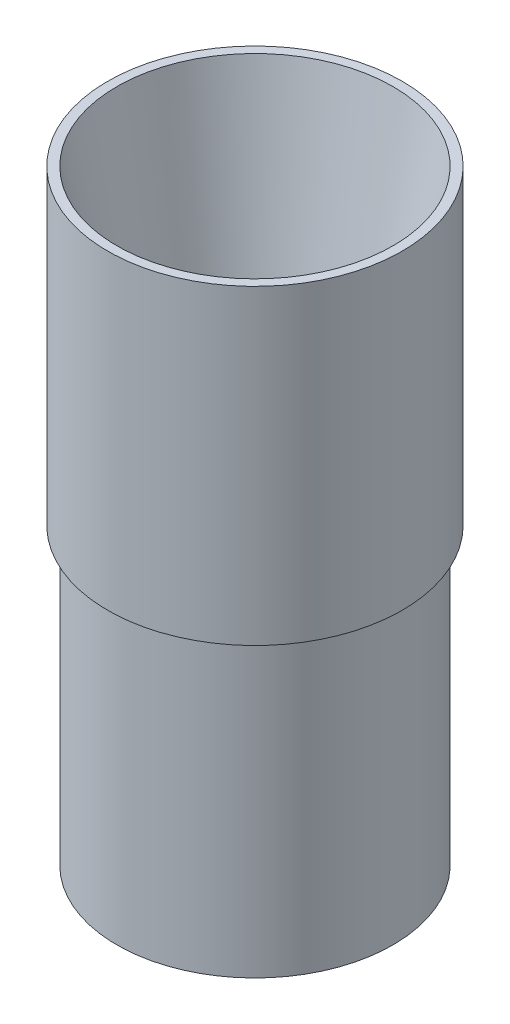
ISO-10303-21;
HEADER;
FILE_DESCRIPTION(('STEP AP214'),'2;1');
FILE_NAME('part.step','',(''),(''),'','','');
FILE_SCHEMA(('AUTOMOTIVE_DESIGN { 1 0 10303 214 1 1 1 1 }'));
ENDSEC;
DATA;
#1=APPLICATION_CONTEXT('core data for automotive mechanical design processes');
#2=APPLICATION_PROTOCOL_DEFINITION('international standard','automotive_design',2000,#1);
#3=PRODUCT_CONTEXT('',#1,'mechanical');
#4=PRODUCT('Part','Part','',(#3));
#5=PRODUCT_RELATED_PRODUCT_CATEGORY('part','',(#4));
#6=PRODUCT_DEFINITION_FORMATION('','',#4);
#7=PRODUCT_DEFINITION_CONTEXT('part definition',#1,'design');
#8=PRODUCT_DEFINITION('design','',#6,#7);
#9=PRODUCT_DEFINITION_SHAPE('','',#8);
#10=(LENGTH_UNIT() NAMED_UNIT(*) SI_UNIT(.MILLI.,.METRE.));
#11=(NAMED_UNIT(*) PLANE_ANGLE_UNIT() SI_UNIT($,.RADIAN.));
#12=(NAMED_UNIT(*) SI_UNIT($,.STERADIAN.) SOLID_ANGLE_UNIT());
#13=UNCERTAINTY_MEASURE_WITH_UNIT(LENGTH_MEASURE(1.E-05),#10,'distance_accuracy_value','');
#14=(GEOMETRIC_REPRESENTATION_CONTEXT(3) GLOBAL_UNCERTAINTY_ASSIGNED_CONTEXT((#13)) GLOBAL_UNIT_ASSIGNED_CONTEXT((#10,
#11,#12)) REPRESENTATION_CONTEXT('',''));
#15=CARTESIAN_POINT('',(0.,0.,0.));
#16=DIRECTION('',(0.,0.,1.));
#17=DIRECTION('',(1.,0.,0.));
#18=AXIS2_PLACEMENT_3D('',#15,#16,#17);
#19=CARTESIAN_POINT('',(41.275,0.,0.));
#20=DIRECTION('',(0.,-1.,0.));
#21=DIRECTION('',(0.,0.,-1.));
#22=AXIS2_PLACEMENT_3D('',#19,#20,#21);
#23=PLANE('',#22);
#24=CARTESIAN_POINT('',(0.,0.,0.));
#25=DIRECTION('',(0.,-1.,0.));
#26=DIRECTION('',(0.,0.,-1.));
#27=AXIS2_PLACEMENT_3D('',#24,#25,#26);
#28=CIRCLE('',#27,41.275);
#29=CARTESIAN_POINT('',(0.,0.,-41.275));
#30=VERTEX_POINT('',#29);
#31=EDGE_CURVE('E10',#30,#30,#28,.T.);
#32=ORIENTED_EDGE('',*,*,#31,.T.);
#33=EDGE_LOOP('',(#32));
#34=FACE_BOUND('',#33,.T.);
#35=CARTESIAN_POINT('',(0.,0.,0.));
#36=DIRECTION('',(0.,-1.,0.));
#37=DIRECTION('',(0.,0.,-1.));
#38=AXIS2_PLACEMENT_3D('',#35,#36,#37);
#39=CIRCLE('',#38,24.2189);
#40=CARTESIAN_POINT('',(0.,0.,-24.2189));
#41=VERTEX_POINT('',#40);
#42=EDGE_CURVE('E64',#41,#41,#39,.T.);
#43=ORIENTED_EDGE('',*,*,#42,.F.);
#44=EDGE_LOOP('',(#43));
#45=FACE_BOUND('',#44,.T.);
#46=ADVANCED_FACE('F36',(#34,#45),#23,.T.);
#47=CARTESIAN_POINT('',(0.,0.,0.));
#48=DIRECTION('',(0.,-1.,0.));
#49=DIRECTION('',(0.,0.,-1.));
#50=AXIS2_PLACEMENT_3D('',#47,#48,#49);
#51=CYLINDRICAL_SURFACE('',#50,41.275);
#52=CARTESIAN_POINT('',(0.,-76.2,0.));
#53=DIRECTION('',(0.,-1.,0.));
#54=DIRECTION('',(0.,0.,-1.));
#55=AXIS2_PLACEMENT_3D('',#52,#53,#54);
#56=CIRCLE('',#55,41.275);
#57=CARTESIAN_POINT('',(0.,-76.2,-41.275));
#58=VERTEX_POINT('',#57);
#59=EDGE_CURVE('E42',#58,#58,#56,.T.);
#60=ORIENTED_EDGE('',*,*,#59,.T.);
#61=EDGE_LOOP('',(#60));
#62=FACE_BOUND('',#61,.T.);
#63=ORIENTED_EDGE('',*,*,#31,.F.);
#64=EDGE_LOOP('',(#63));
#65=FACE_BOUND('',#64,.T.);
#66=ADVANCED_FACE('F72',(#62,#65),#51,.F.);
#67=CARTESIAN_POINT('',(47.625,-76.2,0.));
#68=DIRECTION('',(0.,-1.,0.));
#69=DIRECTION('',(0.,0.,-1.));
#70=AXIS2_PLACEMENT_3D('',#67,#68,#69);
#71=PLANE('',#70);
#72=CARTESIAN_POINT('',(0.,-76.2,0.));
#73=DIRECTION('',(0.,-1.,0.));
#74=DIRECTION('',(0.,0.,-1.));
#75=AXIS2_PLACEMENT_3D('',#72,#73,#74);
#76=CIRCLE('',#75,47.625);
#77=CARTESIAN_POINT('',(0.,-76.2,-47.625));
#78=VERTEX_POINT('',#77);
#79=EDGE_CURVE('E46',#78,#78,#76,.T.);
#80=ORIENTED_EDGE('',*,*,#79,.T.);
#81=EDGE_LOOP('',(#80));
#82=FACE_BOUND('',#81,.T.);
#83=ORIENTED_EDGE('',*,*,#59,.F.);
#84=EDGE_LOOP('',(#83));
#85=FACE_BOUND('',#84,.T.);
#86=ADVANCED_FACE('F76',(#82,#85),#71,.T.);
#87=CARTESIAN_POINT('',(0.,0.,0.));
#88=DIRECTION('',(0.,-1.,0.));
#89=DIRECTION('',(0.,0.,-1.));
#90=AXIS2_PLACEMENT_3D('',#87,#88,#89);
#91=CYLINDRICAL_SURFACE('',#90,47.625);
#92=CARTESIAN_POINT('',(0.,25.4,0.));
#93=DIRECTION('',(0.,-1.,0.));
#94=DIRECTION('',(0.,0.,-1.));
#95=AXIS2_PLACEMENT_3D('',#92,#93,#94);
#96=CIRCLE('',#95,47.625);
#97=CARTESIAN_POINT('',(0.,25.4,-47.625));
#98=VERTEX_POINT('',#97);
#99=EDGE_CURVE('E50',#98,#98,#96,.T.);
#100=ORIENTED_EDGE('',*,*,#99,.T.);
#101=EDGE_LOOP('',(#100));
#102=FACE_BOUND('',#101,.T.);
#103=ORIENTED_EDGE('',*,*,#79,.F.);
#104=EDGE_LOOP('',(#103));
#105=FACE_BOUND('',#104,.T.);
#106=ADVANCED_FACE('F80',(#102,#105),#91,.T.);
#107=CARTESIAN_POINT('',(50.8,25.4,0.));
#108=DIRECTION('',(0.,-1.,0.));
#109=DIRECTION('',(0.,0.,-1.));
#110=AXIS2_PLACEMENT_3D('',#107,#108,#109);
#111=PLANE('',#110);
#112=CARTESIAN_POINT('',(0.,25.4,0.));
#113=DIRECTION('',(0.,-1.,0.));
#114=DIRECTION('',(0.,0.,-1.));
#115=AXIS2_PLACEMENT_3D('',#112,#113,#114);
#116=CIRCLE('',#115,50.8);
#117=CARTESIAN_POINT('',(0.,25.4,-50.8));
#118=VERTEX_POINT('',#117);
#119=EDGE_CURVE('E55',#118,#118,#116,.T.);
#120=ORIENTED_EDGE('',*,*,#119,.T.);
#121=EDGE_LOOP('',(#120));
#122=FACE_BOUND('',#121,.T.);
#123=ORIENTED_EDGE('',*,*,#99,.F.);
#124=EDGE_LOOP('',(#123));
#125=FACE_BOUND('',#124,.T.);
#126=ADVANCED_FACE('F87',(#122,#125),#111,.T.);
#127=CARTESIAN_POINT('',(0.,0.,0.));
#128=DIRECTION('',(0.,-1.,0.));
#129=DIRECTION('',(0.,0.,-1.));
#130=AXIS2_PLACEMENT_3D('',#127,#128,#129);
#131=CYLINDRICAL_SURFACE('',#130,50.8);
#132=CARTESIAN_POINT('',(0.,132.742589398151,0.));
#133=DIRECTION('',(0.,-1.,0.));
#134=DIRECTION('',(0.,0.,-1.));
#135=AXIS2_PLACEMENT_3D('',#132,#133,#134);
#136=CIRCLE('',#135,50.8);
#137=CARTESIAN_POINT('',(0.,132.742589398151,-50.8));
#138=VERTEX_POINT('',#137);
#139=EDGE_CURVE('E58',#138,#138,#136,.T.);
#140=ORIENTED_EDGE('',*,*,#139,.T.);
#141=EDGE_LOOP('',(#140));
#142=FACE_BOUND('',#141,.T.);
#143=ORIENTED_EDGE('',*,*,#119,.F.);
#144=EDGE_LOOP('',(#143));
#145=FACE_BOUND('',#144,.T.);
#146=ADVANCED_FACE('F91',(#142,#145),#131,.T.);
#147=CARTESIAN_POINT('',(47.625,132.742589398151,0.));
#148=DIRECTION('',(0.,1.,0.));
#149=DIRECTION('',(0.,0.,1.));
#150=AXIS2_PLACEMENT_3D('',#147,#148,#149);
#151=PLANE('',#150);
#152=CARTESIAN_POINT('',(0.,132.742589398151,0.));
#153=DIRECTION('',(0.,-1.,0.));
#154=DIRECTION('',(0.,0.,-1.));
#155=AXIS2_PLACEMENT_3D('',#152,#153,#154);
#156=CIRCLE('',#155,47.625);
#157=CARTESIAN_POINT('',(0.,132.742589398151,-47.625));
#158=VERTEX_POINT('',#157);
#159=EDGE_CURVE('E61',#158,#158,#156,.T.);
#160=ORIENTED_EDGE('',*,*,#159,.T.);
#161=EDGE_LOOP('',(#160));
#162=FACE_BOUND('',#161,.T.);
#163=ORIENTED_EDGE('',*,*,#139,.F.);
#164=EDGE_LOOP('',(#163));
#165=FACE_BOUND('',#164,.T.);
#166=ADVANCED_FACE('F95',(#162,#165),#151,.T.);
#167=CARTESIAN_POINT('',(0.,132.742589398151,0.));
#168=DIRECTION('',(0.,1.,0.));
#169=DIRECTION('',(0.,0.,1.));
#170=AXIS2_PLACEMENT_3D('',#167,#168,#169);
#171=CONICAL_SURFACE('',#170,47.625,0.174532925199437);
#172=ORIENTED_EDGE('',*,*,#42,.T.);
#173=EDGE_LOOP('',(#172));
#174=FACE_BOUND('',#173,.T.);
#175=ORIENTED_EDGE('',*,*,#159,.F.);
#176=EDGE_LOOP('',(#175));
#177=FACE_BOUND('',#176,.T.);
#178=ADVANCED_FACE('F68',(#174,#177),#171,.F.);
#179=CLOSED_SHELL('',(#46,#66,#86,#106,#126,#146,#166,#178));
#180=MANIFOLD_SOLID_BREP('B2',#179);
#181=ADVANCED_BREP_SHAPE_REPRESENTATION('',(#18,#180),#14);
#182=SHAPE_DEFINITION_REPRESENTATION(#9,#181);
ENDSEC;
END-ISO-10303-21;
